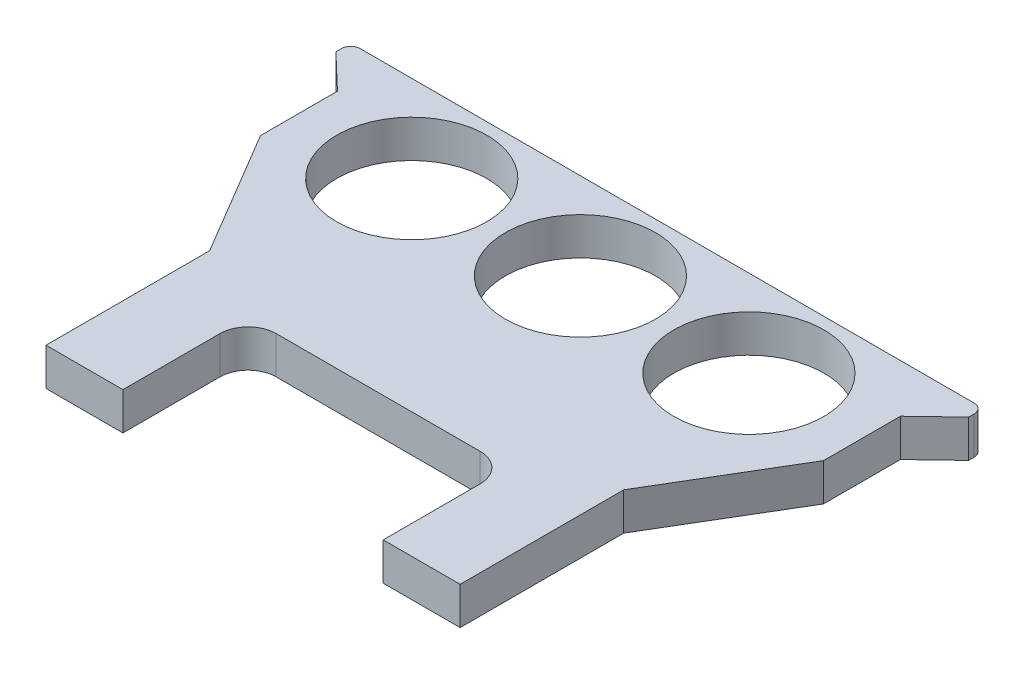
ISO-10303-21;
HEADER;
FILE_DESCRIPTION(('STEP AP214'),'2;1');
FILE_NAME('part.step','',(''),(''),'','','');
FILE_SCHEMA(('AUTOMOTIVE_DESIGN { 1 0 10303 214 1 1 1 1 }'));
ENDSEC;
DATA;
#1=APPLICATION_CONTEXT('core data for automotive mechanical design processes');
#2=APPLICATION_PROTOCOL_DEFINITION('international standard','automotive_design',2000,#1);
#3=PRODUCT_CONTEXT('',#1,'mechanical');
#4=PRODUCT('Part','Part','',(#3));
#5=PRODUCT_RELATED_PRODUCT_CATEGORY('part','',(#4));
#6=PRODUCT_DEFINITION_FORMATION('','',#4);
#7=PRODUCT_DEFINITION_CONTEXT('part definition',#1,'design');
#8=PRODUCT_DEFINITION('design','',#6,#7);
#9=PRODUCT_DEFINITION_SHAPE('','',#8);
#10=(LENGTH_UNIT() NAMED_UNIT(*) SI_UNIT(.MILLI.,.METRE.));
#11=(NAMED_UNIT(*) PLANE_ANGLE_UNIT() SI_UNIT($,.RADIAN.));
#12=(NAMED_UNIT(*) SI_UNIT($,.STERADIAN.) SOLID_ANGLE_UNIT());
#13=UNCERTAINTY_MEASURE_WITH_UNIT(LENGTH_MEASURE(1.E-05),#10,'distance_accuracy_value','');
#14=(GEOMETRIC_REPRESENTATION_CONTEXT(3) GLOBAL_UNCERTAINTY_ASSIGNED_CONTEXT((#13)) GLOBAL_UNIT_ASSIGNED_CONTEXT((#10,
#11,#12)) REPRESENTATION_CONTEXT('',''));
#15=CARTESIAN_POINT('',(0.,0.,0.));
#16=DIRECTION('',(0.,0.,1.));
#17=DIRECTION('',(1.,0.,0.));
#18=AXIS2_PLACEMENT_3D('',#15,#16,#17);
#19=CARTESIAN_POINT('',(-16.3510386858923,2.,-17.200505886366));
#20=DIRECTION('',(0.,-1.,0.));
#21=DIRECTION('',(0.,0.,-1.));
#22=AXIS2_PLACEMENT_3D('',#19,#20,#21);
#23=CYLINDRICAL_SURFACE('',#22,0.5);
#24=CARTESIAN_POINT('',(-16.3510386858923,0.,-17.200505886366));
#25=DIRECTION('',(0.,-1.,0.));
#26=DIRECTION('',(0.,0.,-1.));
#27=AXIS2_PLACEMENT_3D('',#24,#25,#26);
#28=CIRCLE('',#27,0.5);
#29=CARTESIAN_POINT('',(-16.8510386858923,0.,-17.200505886366));
#30=VERTEX_POINT('',#29);
#31=CARTESIAN_POINT('',(-16.3510386858923,0.,-17.700505886366));
#32=VERTEX_POINT('',#31);
#33=EDGE_CURVE('E213',#30,#32,#28,.T.);
#34=ORIENTED_EDGE('',*,*,#33,.F.);
#35=DIRECTION('',(0.,-1.,0.));
#36=VECTOR('',#35,1.);
#37=CARTESIAN_POINT('',(-16.8510386858923,2.,-17.200505886366));
#38=LINE('',#37,#36);
#39=CARTESIAN_POINT('',(-16.8510386858923,2.,-17.200505886366));
#40=VERTEX_POINT('',#39);
#41=EDGE_CURVE('E48',#40,#30,#38,.T.);
#42=ORIENTED_EDGE('',*,*,#41,.F.);
#43=CARTESIAN_POINT('',(-16.3510386858923,2.,-17.200505886366));
#44=DIRECTION('',(0.,-1.,0.));
#45=DIRECTION('',(0.,0.,-1.));
#46=AXIS2_PLACEMENT_3D('',#43,#44,#45);
#47=CIRCLE('',#46,0.5);
#48=CARTESIAN_POINT('',(-16.3510386858923,2.,-17.700505886366));
#49=VERTEX_POINT('',#48);
#50=EDGE_CURVE('E361',#40,#49,#47,.T.);
#51=ORIENTED_EDGE('',*,*,#50,.T.);
#52=DIRECTION('',(0.,-1.,0.));
#53=VECTOR('',#52,1.);
#54=CARTESIAN_POINT('',(-16.3510386858923,2.,-17.700505886366));
#55=LINE('',#54,#53);
#56=EDGE_CURVE('E11',#49,#32,#55,.T.);
#57=ORIENTED_EDGE('',*,*,#56,.T.);
#58=EDGE_LOOP('',(#34,#42,#51,#57));
#59=FACE_BOUND('',#58,.T.);
#60=ADVANCED_FACE('F39',(#59),#23,.T.);
#61=CARTESIAN_POINT('',(-16.8510386858923,2.,-16.9056671422906));
#62=DIRECTION('',(-1.,0.,0.));
#63=DIRECTION('',(0.,0.,1.));
#64=AXIS2_PLACEMENT_3D('',#61,#62,#63);
#65=PLANE('',#64);
#66=DIRECTION('',(0.,0.,-1.));
#67=VECTOR('',#66,1.);
#68=CARTESIAN_POINT('',(-16.8510386858923,0.,-16.9056671422906));
#69=LINE('',#68,#67);
#70=CARTESIAN_POINT('',(-16.8510386858923,0.,-16.9056671422906));
#71=VERTEX_POINT('',#70);
#72=EDGE_CURVE('E217',#71,#30,#69,.T.);
#73=ORIENTED_EDGE('',*,*,#72,.F.);
#74=DIRECTION('',(0.,-1.,0.));
#75=VECTOR('',#74,1.);
#76=CARTESIAN_POINT('',(-16.8510386858923,2.,-16.9056671422906));
#77=LINE('',#76,#75);
#78=CARTESIAN_POINT('',(-16.8510386858923,2.,-16.9056671422906));
#79=VERTEX_POINT('',#78);
#80=EDGE_CURVE('E334',#79,#71,#77,.T.);
#81=ORIENTED_EDGE('',*,*,#80,.F.);
#82=DIRECTION('',(0.,0.,-1.));
#83=VECTOR('',#82,1.);
#84=CARTESIAN_POINT('',(-16.8510386858923,2.,-16.9056671422906));
#85=LINE('',#84,#83);
#86=EDGE_CURVE('E343',#79,#40,#85,.T.);
#87=ORIENTED_EDGE('',*,*,#86,.T.);
#88=ORIENTED_EDGE('',*,*,#41,.T.);
#89=EDGE_LOOP('',(#73,#81,#87,#88));
#90=FACE_BOUND('',#89,.T.);
#91=ADVANCED_FACE('F341',(#90),#65,.T.);
#92=CARTESIAN_POINT('',(-16.8510386858923,2.,-16.9056671422906));
#93=DIRECTION('',(0.690724224095173,0.,-0.723118279569893));
#94=DIRECTION('',(-0.723118279569893,0.,-0.690724224095173));
#95=AXIS2_PLACEMENT_3D('',#92,#93,#94);
#96=PLANE('',#95);
#97=DIRECTION('',(0.723118279569893,0.,0.690724224095173));
#98=VECTOR('',#97,1.);
#99=CARTESIAN_POINT('',(-16.8510386858923,0.,-16.9056671422906));
#100=LINE('',#99,#98);
#101=CARTESIAN_POINT('',(-14.9926247073977,0.,-15.130505886366));
#102=VERTEX_POINT('',#101);
#103=EDGE_CURVE('E222',#71,#102,#100,.T.);
#104=ORIENTED_EDGE('',*,*,#103,.T.);
#105=DIRECTION('',(0.,-1.,0.));
#106=VECTOR('',#105,1.);
#107=CARTESIAN_POINT('',(-14.9926247073977,2.,-15.130505886366));
#108=LINE('',#107,#106);
#109=CARTESIAN_POINT('',(-14.9926247073977,2.,-15.130505886366));
#110=VERTEX_POINT('',#109);
#111=EDGE_CURVE('E331',#110,#102,#108,.T.);
#112=ORIENTED_EDGE('',*,*,#111,.F.);
#113=DIRECTION('',(0.723118279569893,0.,0.690724224095173));
#114=VECTOR('',#113,1.);
#115=CARTESIAN_POINT('',(-16.8510386858923,2.,-16.9056671422906));
#116=LINE('',#115,#114);
#117=EDGE_CURVE('E356',#79,#110,#116,.T.);
#118=ORIENTED_EDGE('',*,*,#117,.F.);
#119=ORIENTED_EDGE('',*,*,#80,.T.);
#120=EDGE_LOOP('',(#104,#112,#118,#119));
#121=FACE_BOUND('',#120,.T.);
#122=ADVANCED_FACE('F353',(#121),#96,.F.);
#123=CARTESIAN_POINT('',(-14.9926247073977,2.,-11.030505886366));
#124=DIRECTION('',(-1.,0.,0.));
#125=DIRECTION('',(0.,0.,1.));
#126=AXIS2_PLACEMENT_3D('',#123,#124,#125);
#127=PLANE('',#126);
#128=DIRECTION('',(0.,0.,-1.));
#129=VECTOR('',#128,1.);
#130=CARTESIAN_POINT('',(-14.9926247073977,0.,-11.030505886366));
#131=LINE('',#130,#129);
#132=CARTESIAN_POINT('',(-14.9926247073977,0.,-11.030505886366));
#133=VERTEX_POINT('',#132);
#134=EDGE_CURVE('E226',#133,#102,#131,.T.);
#135=ORIENTED_EDGE('',*,*,#134,.F.);
#136=DIRECTION('',(0.,-1.,0.));
#137=VECTOR('',#136,1.);
#138=CARTESIAN_POINT('',(-14.9926247073977,2.,-11.030505886366));
#139=LINE('',#138,#137);
#140=CARTESIAN_POINT('',(-14.9926247073977,2.,-11.030505886366));
#141=VERTEX_POINT('',#140);
#142=EDGE_CURVE('E328',#141,#133,#139,.T.);
#143=ORIENTED_EDGE('',*,*,#142,.F.);
#144=DIRECTION('',(0.,0.,-1.));
#145=VECTOR('',#144,1.);
#146=CARTESIAN_POINT('',(-14.9926247073977,2.,-11.030505886366));
#147=LINE('',#146,#145);
#148=EDGE_CURVE('E359',#141,#110,#147,.T.);
#149=ORIENTED_EDGE('',*,*,#148,.T.);
#150=ORIENTED_EDGE('',*,*,#111,.T.);
#151=EDGE_LOOP('',(#135,#143,#149,#150));
#152=FACE_BOUND('',#151,.T.);
#153=ADVANCED_FACE('F434',(#152),#127,.T.);
#154=CARTESIAN_POINT('',(-14.9926247073977,2.,-11.030505886366));
#155=DIRECTION('',(0.860023822414832,0.,-0.51025388276718));
#156=DIRECTION('',(-0.51025388276718,0.,-0.860023822414832));
#157=AXIS2_PLACEMENT_3D('',#154,#155,#156);
#158=PLANE('',#157);
#159=DIRECTION('',(0.51025388276718,0.,0.860023822414832));
#160=VECTOR('',#159,1.);
#161=CARTESIAN_POINT('',(-14.9926247073977,0.,-11.030505886366));
#162=LINE('',#161,#160);
#163=CARTESIAN_POINT('',(-11.035,0.,-4.36));
#164=VERTEX_POINT('',#163);
#165=EDGE_CURVE('E230',#133,#164,#162,.T.);
#166=ORIENTED_EDGE('',*,*,#165,.T.);
#167=DIRECTION('',(0.,-1.,0.));
#168=VECTOR('',#167,1.);
#169=CARTESIAN_POINT('',(-11.035,2.,-4.36));
#170=LINE('',#169,#168);
#171=CARTESIAN_POINT('',(-11.035,2.,-4.36));
#172=VERTEX_POINT('',#171);
#173=EDGE_CURVE('E325',#172,#164,#170,.T.);
#174=ORIENTED_EDGE('',*,*,#173,.F.);
#175=DIRECTION('',(0.51025388276718,0.,0.860023822414832));
#176=VECTOR('',#175,1.);
#177=CARTESIAN_POINT('',(-14.9926247073977,2.,-11.030505886366));
#178=LINE('',#177,#176);
#179=EDGE_CURVE('E370',#141,#172,#178,.T.);
#180=ORIENTED_EDGE('',*,*,#179,.F.);
#181=ORIENTED_EDGE('',*,*,#142,.T.);
#182=EDGE_LOOP('',(#166,#174,#180,#181));
#183=FACE_BOUND('',#182,.T.);
#184=ADVANCED_FACE('F439',(#183),#158,.F.);
#185=CARTESIAN_POINT('',(-11.035,2.,4.36));
#186=DIRECTION('',(-1.,0.,0.));
#187=DIRECTION('',(0.,0.,1.));
#188=AXIS2_PLACEMENT_3D('',#185,#186,#187);
#189=PLANE('',#188);
#190=DIRECTION('',(0.,0.,-1.));
#191=VECTOR('',#190,1.);
#192=CARTESIAN_POINT('',(-11.035,0.,4.36));
#193=LINE('',#192,#191);
#194=CARTESIAN_POINT('',(-11.035,0.,4.36));
#195=VERTEX_POINT('',#194);
#196=EDGE_CURVE('E234',#195,#164,#193,.T.);
#197=ORIENTED_EDGE('',*,*,#196,.F.);
#198=DIRECTION('',(0.,-1.,0.));
#199=VECTOR('',#198,1.);
#200=CARTESIAN_POINT('',(-11.035,2.,4.36));
#201=LINE('',#200,#199);
#202=CARTESIAN_POINT('',(-11.035,2.,4.36));
#203=VERTEX_POINT('',#202);
#204=EDGE_CURVE('E322',#203,#195,#201,.T.);
#205=ORIENTED_EDGE('',*,*,#204,.F.);
#206=DIRECTION('',(0.,0.,-1.));
#207=VECTOR('',#206,1.);
#208=CARTESIAN_POINT('',(-11.035,2.,4.36));
#209=LINE('',#208,#207);
#210=EDGE_CURVE('E373',#203,#172,#209,.T.);
#211=ORIENTED_EDGE('',*,*,#210,.T.);
#212=ORIENTED_EDGE('',*,*,#173,.T.);
#213=EDGE_LOOP('',(#197,#205,#211,#212));
#214=FACE_BOUND('',#213,.T.);
#215=ADVANCED_FACE('F443',(#214),#189,.T.);
#216=CARTESIAN_POINT('',(-11.035,2.,4.36));
#217=DIRECTION('',(0.,0.,-1.));
#218=DIRECTION('',(-1.,0.,0.));
#219=AXIS2_PLACEMENT_3D('',#216,#217,#218);
#220=PLANE('',#219);
#221=DIRECTION('',(1.,0.,0.));
#222=VECTOR('',#221,1.);
#223=CARTESIAN_POINT('',(-11.035,0.,4.36));
#224=LINE('',#223,#222);
#225=CARTESIAN_POINT('',(-6.935,0.,4.36));
#226=VERTEX_POINT('',#225);
#227=EDGE_CURVE('E238',#195,#226,#224,.T.);
#228=ORIENTED_EDGE('',*,*,#227,.T.);
#229=DIRECTION('',(0.,-1.,0.));
#230=VECTOR('',#229,1.);
#231=CARTESIAN_POINT('',(-6.935,2.,4.36));
#232=LINE('',#231,#230);
#233=CARTESIAN_POINT('',(-6.935,2.,4.36));
#234=VERTEX_POINT('',#233);
#235=EDGE_CURVE('E318',#234,#226,#232,.T.);
#236=ORIENTED_EDGE('',*,*,#235,.F.);
#237=DIRECTION('',(1.,0.,0.));
#238=VECTOR('',#237,1.);
#239=CARTESIAN_POINT('',(-11.035,2.,4.36));
#240=LINE('',#239,#238);
#241=EDGE_CURVE('E377',#203,#234,#240,.T.);
#242=ORIENTED_EDGE('',*,*,#241,.F.);
#243=ORIENTED_EDGE('',*,*,#204,.T.);
#244=EDGE_LOOP('',(#228,#236,#242,#243));
#245=FACE_BOUND('',#244,.T.);
#246=ADVANCED_FACE('F447',(#245),#220,.F.);
#247=CARTESIAN_POINT('',(-6.935,2.,4.36));
#248=DIRECTION('',(-1.,0.,0.));
#249=DIRECTION('',(0.,0.,1.));
#250=AXIS2_PLACEMENT_3D('',#247,#248,#249);
#251=PLANE('',#250);
#252=DIRECTION('',(0.,0.,-1.));
#253=VECTOR('',#252,1.);
#254=CARTESIAN_POINT('',(-6.935,0.,4.36));
#255=LINE('',#254,#253);
#256=CARTESIAN_POINT('',(-6.935,0.,-0.80999999999999));
#257=VERTEX_POINT('',#256);
#258=EDGE_CURVE('E241',#226,#257,#255,.T.);
#259=ORIENTED_EDGE('',*,*,#258,.T.);
#260=DIRECTION('',(0.,-1.,0.));
#261=VECTOR('',#260,1.);
#262=CARTESIAN_POINT('',(-6.935,2.,-0.80999999999999));
#263=LINE('',#262,#261);
#264=CARTESIAN_POINT('',(-6.935,2.,-0.80999999999999));
#265=VERTEX_POINT('',#264);
#266=EDGE_CURVE('E315',#265,#257,#263,.T.);
#267=ORIENTED_EDGE('',*,*,#266,.F.);
#268=DIRECTION('',(0.,0.,-1.));
#269=VECTOR('',#268,1.);
#270=CARTESIAN_POINT('',(-6.935,2.,4.36));
#271=LINE('',#270,#269);
#272=EDGE_CURVE('E380',#234,#265,#271,.T.);
#273=ORIENTED_EDGE('',*,*,#272,.F.);
#274=ORIENTED_EDGE('',*,*,#235,.T.);
#275=EDGE_LOOP('',(#259,#267,#273,#274));
#276=FACE_BOUND('',#275,.T.);
#277=ADVANCED_FACE('F451',(#276),#251,.F.);
#278=CARTESIAN_POINT('',(-5.435,2.,-0.810000000000001));
#279=DIRECTION('',(0.,-1.,0.));
#280=DIRECTION('',(0.,0.,-1.));
#281=AXIS2_PLACEMENT_3D('',#278,#279,#280);
#282=CYLINDRICAL_SURFACE('',#281,1.5);
#283=CARTESIAN_POINT('',(-5.435,0.,-0.810000000000001));
#284=DIRECTION('',(0.,1.,0.));
#285=DIRECTION('',(0.,0.,1.));
#286=AXIS2_PLACEMENT_3D('',#283,#284,#285);
#287=CIRCLE('',#286,1.5);
#288=CARTESIAN_POINT('',(-5.43499999999999,0.,-2.31));
#289=VERTEX_POINT('',#288);
#290=EDGE_CURVE('E245',#289,#257,#287,.T.);
#291=ORIENTED_EDGE('',*,*,#290,.F.);
#292=DIRECTION('',(0.,-1.,0.));
#293=VECTOR('',#292,1.);
#294=CARTESIAN_POINT('',(-5.43499999999999,2.,-2.31));
#295=LINE('',#294,#293);
#296=CARTESIAN_POINT('',(-5.43499999999999,2.,-2.31));
#297=VERTEX_POINT('',#296);
#298=EDGE_CURVE('E312',#297,#289,#295,.T.);
#299=ORIENTED_EDGE('',*,*,#298,.F.);
#300=CARTESIAN_POINT('',(-5.435,2.,-0.810000000000001));
#301=DIRECTION('',(0.,1.,0.));
#302=DIRECTION('',(0.,0.,1.));
#303=AXIS2_PLACEMENT_3D('',#300,#301,#302);
#304=CIRCLE('',#303,1.5);
#305=EDGE_CURVE('E383',#297,#265,#304,.T.);
#306=ORIENTED_EDGE('',*,*,#305,.T.);
#307=ORIENTED_EDGE('',*,*,#266,.T.);
#308=EDGE_LOOP('',(#291,#299,#306,#307));
#309=FACE_BOUND('',#308,.T.);
#310=ADVANCED_FACE('F455',(#309),#282,.F.);
#311=CARTESIAN_POINT('',(-5.43499999999999,2.,-2.31));
#312=DIRECTION('',(0.,0.,-1.));
#313=DIRECTION('',(-1.,0.,0.));
#314=AXIS2_PLACEMENT_3D('',#311,#312,#313);
#315=PLANE('',#314);
#316=DIRECTION('',(1.,0.,0.));
#317=VECTOR('',#316,1.);
#318=CARTESIAN_POINT('',(-5.43499999999999,0.,-2.31));
#319=LINE('',#318,#317);
#320=CARTESIAN_POINT('',(5.43499999999999,0.,-2.31));
#321=VERTEX_POINT('',#320);
#322=EDGE_CURVE('E249',#289,#321,#319,.T.);
#323=ORIENTED_EDGE('',*,*,#322,.T.);
#324=DIRECTION('',(0.,-1.,0.));
#325=VECTOR('',#324,1.);
#326=CARTESIAN_POINT('',(5.43499999999999,2.,-2.31));
#327=LINE('',#326,#325);
#328=CARTESIAN_POINT('',(5.43499999999999,2.,-2.31));
#329=VERTEX_POINT('',#328);
#330=EDGE_CURVE('E308',#329,#321,#327,.T.);
#331=ORIENTED_EDGE('',*,*,#330,.F.);
#332=DIRECTION('',(1.,0.,0.));
#333=VECTOR('',#332,1.);
#334=CARTESIAN_POINT('',(-5.43499999999999,2.,-2.31));
#335=LINE('',#334,#333);
#336=EDGE_CURVE('E387',#297,#329,#335,.T.);
#337=ORIENTED_EDGE('',*,*,#336,.F.);
#338=ORIENTED_EDGE('',*,*,#298,.T.);
#339=EDGE_LOOP('',(#323,#331,#337,#338));
#340=FACE_BOUND('',#339,.T.);
#341=ADVANCED_FACE('F459',(#340),#315,.F.);
#342=CARTESIAN_POINT('',(5.435,2.,-0.810000000000001));
#343=DIRECTION('',(0.,-1.,0.));
#344=DIRECTION('',(0.,0.,-1.));
#345=AXIS2_PLACEMENT_3D('',#342,#343,#344);
#346=CYLINDRICAL_SURFACE('',#345,1.5);
#347=CARTESIAN_POINT('',(5.435,0.,-0.810000000000001));
#348=DIRECTION('',(0.,-1.,0.));
#349=DIRECTION('',(0.,0.,-1.));
#350=AXIS2_PLACEMENT_3D('',#347,#348,#349);
#351=CIRCLE('',#350,1.5);
#352=CARTESIAN_POINT('',(6.935,0.,-0.80999999999999));
#353=VERTEX_POINT('',#352);
#354=EDGE_CURVE('E252',#321,#353,#351,.T.);
#355=ORIENTED_EDGE('',*,*,#354,.T.);
#356=DIRECTION('',(0.,-1.,0.));
#357=VECTOR('',#356,1.);
#358=CARTESIAN_POINT('',(6.935,2.,-0.80999999999999));
#359=LINE('',#358,#357);
#360=CARTESIAN_POINT('',(6.935,2.,-0.80999999999999));
#361=VERTEX_POINT('',#360);
#362=EDGE_CURVE('E305',#361,#353,#359,.T.);
#363=ORIENTED_EDGE('',*,*,#362,.F.);
#364=CARTESIAN_POINT('',(5.435,2.,-0.810000000000001));
#365=DIRECTION('',(0.,-1.,0.));
#366=DIRECTION('',(0.,0.,-1.));
#367=AXIS2_PLACEMENT_3D('',#364,#365,#366);
#368=CIRCLE('',#367,1.5);
#369=EDGE_CURVE('E390',#329,#361,#368,.T.);
#370=ORIENTED_EDGE('',*,*,#369,.F.);
#371=ORIENTED_EDGE('',*,*,#330,.T.);
#372=EDGE_LOOP('',(#355,#363,#370,#371));
#373=FACE_BOUND('',#372,.T.);
#374=ADVANCED_FACE('F463',(#373),#346,.F.);
#375=CARTESIAN_POINT('',(6.935,2.,4.36));
#376=DIRECTION('',(-1.,0.,0.));
#377=DIRECTION('',(0.,0.,1.));
#378=AXIS2_PLACEMENT_3D('',#375,#376,#377);
#379=PLANE('',#378);
#380=DIRECTION('',(0.,0.,-1.));
#381=VECTOR('',#380,1.);
#382=CARTESIAN_POINT('',(6.935,0.,4.36));
#383=LINE('',#382,#381);
#384=CARTESIAN_POINT('',(6.935,0.,4.36));
#385=VERTEX_POINT('',#384);
#386=EDGE_CURVE('E256',#385,#353,#383,.T.);
#387=ORIENTED_EDGE('',*,*,#386,.F.);
#388=DIRECTION('',(0.,-1.,0.));
#389=VECTOR('',#388,1.);
#390=CARTESIAN_POINT('',(6.935,2.,4.36));
#391=LINE('',#390,#389);
#392=CARTESIAN_POINT('',(6.935,2.,4.36));
#393=VERTEX_POINT('',#392);
#394=EDGE_CURVE('E302',#393,#385,#391,.T.);
#395=ORIENTED_EDGE('',*,*,#394,.F.);
#396=DIRECTION('',(0.,0.,-1.));
#397=VECTOR('',#396,1.);
#398=CARTESIAN_POINT('',(6.935,2.,4.36));
#399=LINE('',#398,#397);
#400=EDGE_CURVE('E393',#393,#361,#399,.T.);
#401=ORIENTED_EDGE('',*,*,#400,.T.);
#402=ORIENTED_EDGE('',*,*,#362,.T.);
#403=EDGE_LOOP('',(#387,#395,#401,#402));
#404=FACE_BOUND('',#403,.T.);
#405=ADVANCED_FACE('F467',(#404),#379,.T.);
#406=CARTESIAN_POINT('',(6.935,2.,4.36));
#407=DIRECTION('',(0.,0.,-1.));
#408=DIRECTION('',(-1.,0.,0.));
#409=AXIS2_PLACEMENT_3D('',#406,#407,#408);
#410=PLANE('',#409);
#411=DIRECTION('',(1.,0.,0.));
#412=VECTOR('',#411,1.);
#413=CARTESIAN_POINT('',(6.935,0.,4.36));
#414=LINE('',#413,#412);
#415=CARTESIAN_POINT('',(11.035,0.,4.36));
#416=VERTEX_POINT('',#415);
#417=EDGE_CURVE('E260',#385,#416,#414,.T.);
#418=ORIENTED_EDGE('',*,*,#417,.T.);
#419=DIRECTION('',(0.,-1.,0.));
#420=VECTOR('',#419,1.);
#421=CARTESIAN_POINT('',(11.035,2.,4.36));
#422=LINE('',#421,#420);
#423=CARTESIAN_POINT('',(11.035,2.,4.36));
#424=VERTEX_POINT('',#423);
#425=EDGE_CURVE('E298',#424,#416,#422,.T.);
#426=ORIENTED_EDGE('',*,*,#425,.F.);
#427=DIRECTION('',(1.,0.,0.));
#428=VECTOR('',#427,1.);
#429=CARTESIAN_POINT('',(6.935,2.,4.36));
#430=LINE('',#429,#428);
#431=EDGE_CURVE('E397',#393,#424,#430,.T.);
#432=ORIENTED_EDGE('',*,*,#431,.F.);
#433=ORIENTED_EDGE('',*,*,#394,.T.);
#434=EDGE_LOOP('',(#418,#426,#432,#433));
#435=FACE_BOUND('',#434,.T.);
#436=ADVANCED_FACE('F471',(#435),#410,.F.);
#437=CARTESIAN_POINT('',(11.035,2.,4.36));
#438=DIRECTION('',(-1.,0.,0.));
#439=DIRECTION('',(0.,0.,1.));
#440=AXIS2_PLACEMENT_3D('',#437,#438,#439);
#441=PLANE('',#440);
#442=DIRECTION('',(0.,0.,-1.));
#443=VECTOR('',#442,1.);
#444=CARTESIAN_POINT('',(11.035,0.,4.36));
#445=LINE('',#444,#443);
#446=CARTESIAN_POINT('',(11.035,0.,-4.36));
#447=VERTEX_POINT('',#446);
#448=EDGE_CURVE('E263',#416,#447,#445,.T.);
#449=ORIENTED_EDGE('',*,*,#448,.T.);
#450=DIRECTION('',(0.,-1.,0.));
#451=VECTOR('',#450,1.);
#452=CARTESIAN_POINT('',(11.035,2.,-4.36));
#453=LINE('',#452,#451);
#454=CARTESIAN_POINT('',(11.035,2.,-4.36));
#455=VERTEX_POINT('',#454);
#456=EDGE_CURVE('E295',#455,#447,#453,.T.);
#457=ORIENTED_EDGE('',*,*,#456,.F.);
#458=DIRECTION('',(0.,0.,-1.));
#459=VECTOR('',#458,1.);
#460=CARTESIAN_POINT('',(11.035,2.,4.36));
#461=LINE('',#460,#459);
#462=EDGE_CURVE('E400',#424,#455,#461,.T.);
#463=ORIENTED_EDGE('',*,*,#462,.F.);
#464=ORIENTED_EDGE('',*,*,#425,.T.);
#465=EDGE_LOOP('',(#449,#457,#463,#464));
#466=FACE_BOUND('',#465,.T.);
#467=ADVANCED_FACE('F413',(#466),#441,.F.);
#468=CARTESIAN_POINT('',(15.01,2.,-11.03));
#469=DIRECTION('',(0.859023219069794,0.,0.511936626057336));
#470=DIRECTION('',(0.511936626057336,0.,-0.859023219069794));
#471=AXIS2_PLACEMENT_3D('',#468,#469,#470);
#472=PLANE('',#471);
#473=DIRECTION('',(-0.511936626057336,0.,0.859023219069794));
#474=VECTOR('',#473,1.);
#475=CARTESIAN_POINT('',(15.01,0.,-11.03));
#476=LINE('',#475,#474);
#477=CARTESIAN_POINT('',(15.01,0.,-11.03));
#478=VERTEX_POINT('',#477);
#479=EDGE_CURVE('E267',#478,#447,#476,.T.);
#480=ORIENTED_EDGE('',*,*,#479,.F.);
#481=DIRECTION('',(0.,-1.,0.));
#482=VECTOR('',#481,1.);
#483=CARTESIAN_POINT('',(15.01,2.,-11.03));
#484=LINE('',#483,#482);
#485=CARTESIAN_POINT('',(15.01,2.,-11.03));
#486=VERTEX_POINT('',#485);
#487=EDGE_CURVE('E292',#486,#478,#484,.T.);
#488=ORIENTED_EDGE('',*,*,#487,.F.);
#489=DIRECTION('',(-0.511936626057336,0.,0.859023219069794));
#490=VECTOR('',#489,1.);
#491=CARTESIAN_POINT('',(15.01,2.,-11.03));
#492=LINE('',#491,#490);
#493=EDGE_CURVE('E207',#486,#455,#492,.T.);
#494=ORIENTED_EDGE('',*,*,#493,.T.);
#495=ORIENTED_EDGE('',*,*,#456,.T.);
#496=EDGE_LOOP('',(#480,#488,#494,#495));
#497=FACE_BOUND('',#496,.T.);
#498=ADVANCED_FACE('F406',(#497),#472,.T.);
#499=CARTESIAN_POINT('',(15.01,2.,-11.03));
#500=DIRECTION('',(-1.,0.,0.));
#501=DIRECTION('',(0.,0.,1.));
#502=AXIS2_PLACEMENT_3D('',#499,#500,#501);
#503=PLANE('',#502);
#504=DIRECTION('',(0.,0.,-1.));
#505=VECTOR('',#504,1.);
#506=CARTESIAN_POINT('',(15.01,0.,-11.03));
#507=LINE('',#506,#505);
#508=CARTESIAN_POINT('',(15.01,0.,-15.13));
#509=VERTEX_POINT('',#508);
#510=EDGE_CURVE('E271',#478,#509,#507,.T.);
#511=ORIENTED_EDGE('',*,*,#510,.T.);
#512=DIRECTION('',(0.,-1.,0.));
#513=VECTOR('',#512,1.);
#514=CARTESIAN_POINT('',(15.01,2.,-15.13));
#515=LINE('',#514,#513);
#516=CARTESIAN_POINT('',(15.01,2.,-15.13));
#517=VERTEX_POINT('',#516);
#518=EDGE_CURVE('E190',#517,#509,#515,.T.);
#519=ORIENTED_EDGE('',*,*,#518,.F.);
#520=DIRECTION('',(0.,0.,-1.));
#521=VECTOR('',#520,1.);
#522=CARTESIAN_POINT('',(15.01,2.,-11.03));
#523=LINE('',#522,#521);
#524=EDGE_CURVE('E202',#486,#517,#523,.T.);
#525=ORIENTED_EDGE('',*,*,#524,.F.);
#526=ORIENTED_EDGE('',*,*,#487,.T.);
#527=EDGE_LOOP('',(#511,#519,#525,#526));
#528=FACE_BOUND('',#527,.T.);
#529=ADVANCED_FACE('F418',(#528),#503,.F.);
#530=CARTESIAN_POINT('',(16.868239420902,2.,-16.9053439820513));
#531=DIRECTION('',(0.690795323755383,0.,0.723050358327618));
#532=DIRECTION('',(0.723050358327618,0.,-0.690795323755383));
#533=AXIS2_PLACEMENT_3D('',#530,#531,#532);
#534=PLANE('',#533);
#535=DIRECTION('',(-0.723050358327618,0.,0.690795323755382));
#536=VECTOR('',#535,1.);
#537=CARTESIAN_POINT('',(16.868239420902,0.,-16.9053439820513));
#538=LINE('',#537,#536);
#539=CARTESIAN_POINT('',(16.868239420902,0.,-16.9053439820513));
#540=VERTEX_POINT('',#539);
#541=EDGE_CURVE('E188',#540,#509,#538,.T.);
#542=ORIENTED_EDGE('',*,*,#541,.F.);
#543=DIRECTION('',(0.,-1.,0.));
#544=VECTOR('',#543,1.);
#545=CARTESIAN_POINT('',(16.868239420902,2.,-16.9053439820513));
#546=LINE('',#545,#544);
#547=CARTESIAN_POINT('',(16.868239420902,2.,-16.9053439820513));
#548=VERTEX_POINT('',#547);
#549=EDGE_CURVE('E182',#548,#540,#546,.T.);
#550=ORIENTED_EDGE('',*,*,#549,.F.);
#551=DIRECTION('',(-0.723050358327618,0.,0.690795323755382));
#552=VECTOR('',#551,1.);
#553=CARTESIAN_POINT('',(16.868239420902,2.,-16.9053439820513));
#554=LINE('',#553,#552);
#555=EDGE_CURVE('E186',#548,#517,#554,.T.);
#556=ORIENTED_EDGE('',*,*,#555,.T.);
#557=ORIENTED_EDGE('',*,*,#518,.T.);
#558=EDGE_LOOP('',(#542,#550,#556,#557));
#559=FACE_BOUND('',#558,.T.);
#560=ADVANCED_FACE('F184',(#559),#534,.T.);
#561=CARTESIAN_POINT('',(16.868239420902,2.,-16.9053439820513));
#562=DIRECTION('',(-1.,0.,0.));
#563=DIRECTION('',(0.,0.,1.));
#564=AXIS2_PLACEMENT_3D('',#561,#562,#563);
#565=PLANE('',#564);
#566=DIRECTION('',(0.,0.,-1.));
#567=VECTOR('',#566,1.);
#568=CARTESIAN_POINT('',(16.868239420902,0.,-16.9053439820513));
#569=LINE('',#568,#567);
#570=CARTESIAN_POINT('',(16.868239420902,0.,-17.200505886366));
#571=VERTEX_POINT('',#570);
#572=EDGE_CURVE('E121',#540,#571,#569,.T.);
#573=ORIENTED_EDGE('',*,*,#572,.T.);
#574=DIRECTION('',(0.,-1.,0.));
#575=VECTOR('',#574,1.);
#576=CARTESIAN_POINT('',(16.868239420902,2.,-17.200505886366));
#577=LINE('',#576,#575);
#578=CARTESIAN_POINT('',(16.868239420902,2.,-17.200505886366));
#579=VERTEX_POINT('',#578);
#580=EDGE_CURVE('E191',#579,#571,#577,.T.);
#581=ORIENTED_EDGE('',*,*,#580,.F.);
#582=DIRECTION('',(0.,0.,-1.));
#583=VECTOR('',#582,1.);
#584=CARTESIAN_POINT('',(16.868239420902,2.,-16.9053439820513));
#585=LINE('',#584,#583);
#586=EDGE_CURVE('E193',#548,#579,#585,.T.);
#587=ORIENTED_EDGE('',*,*,#586,.F.);
#588=ORIENTED_EDGE('',*,*,#549,.T.);
#589=EDGE_LOOP('',(#573,#581,#587,#588));
#590=FACE_BOUND('',#589,.T.);
#591=ADVANCED_FACE('F194',(#590),#565,.F.);
#592=CARTESIAN_POINT('',(16.368239420902,2.,-17.200505886366));
#593=DIRECTION('',(0.,-1.,0.));
#594=DIRECTION('',(0.,0.,-1.));
#595=AXIS2_PLACEMENT_3D('',#592,#593,#594);
#596=CYLINDRICAL_SURFACE('',#595,0.5);
#597=CARTESIAN_POINT('',(16.368239420902,0.,-17.200505886366));
#598=DIRECTION('',(0.,1.,0.));
#599=DIRECTION('',(0.,0.,1.));
#600=AXIS2_PLACEMENT_3D('',#597,#598,#599);
#601=CIRCLE('',#600,0.5);
#602=CARTESIAN_POINT('',(16.368239420902,0.,-17.700505886366));
#603=VERTEX_POINT('',#602);
#604=EDGE_CURVE('E279',#571,#603,#601,.T.);
#605=ORIENTED_EDGE('',*,*,#604,.T.);
#606=DIRECTION('',(0.,-1.,0.));
#607=VECTOR('',#606,1.);
#608=CARTESIAN_POINT('',(16.368239420902,2.,-17.700505886366));
#609=LINE('',#608,#607);
#610=CARTESIAN_POINT('',(16.368239420902,2.,-17.700505886366));
#611=VERTEX_POINT('',#610);
#612=EDGE_CURVE('E125',#611,#603,#609,.T.);
#613=ORIENTED_EDGE('',*,*,#612,.F.);
#614=CARTESIAN_POINT('',(16.368239420902,2.,-17.200505886366));
#615=DIRECTION('',(0.,1.,0.));
#616=DIRECTION('',(0.,0.,1.));
#617=AXIS2_PLACEMENT_3D('',#614,#615,#616);
#618=CIRCLE('',#617,0.5);
#619=EDGE_CURVE('E197',#579,#611,#618,.T.);
#620=ORIENTED_EDGE('',*,*,#619,.F.);
#621=ORIENTED_EDGE('',*,*,#580,.T.);
#622=EDGE_LOOP('',(#605,#613,#620,#621));
#623=FACE_BOUND('',#622,.T.);
#624=ADVANCED_FACE('F504',(#623),#596,.T.);
#625=CARTESIAN_POINT('',(-14.9926247073977,2.,-17.700505886366));
#626=DIRECTION('',(0.,0.,-1.));
#627=DIRECTION('',(-1.,0.,0.));
#628=AXIS2_PLACEMENT_3D('',#625,#626,#627);
#629=PLANE('',#628);
#630=DIRECTION('',(1.,0.,0.));
#631=VECTOR('',#630,1.);
#632=CARTESIAN_POINT('',(-14.9926247073977,0.,-17.700505886366));
#633=LINE('',#632,#631);
#634=EDGE_CURVE('E282',#32,#603,#633,.T.);
#635=ORIENTED_EDGE('',*,*,#634,.F.);
#636=ORIENTED_EDGE('',*,*,#56,.F.);
#637=DIRECTION('',(-1.,0.,0.));
#638=VECTOR('',#637,1.);
#639=CARTESIAN_POINT('',(-14.9926247073977,2.,-17.700505886366));
#640=LINE('',#639,#638);
#641=EDGE_CURVE('E56',#611,#49,#640,.T.);
#642=ORIENTED_EDGE('',*,*,#641,.F.);
#643=ORIENTED_EDGE('',*,*,#612,.T.);
#644=EDGE_LOOP('',(#635,#636,#642,#643));
#645=FACE_BOUND('',#644,.T.);
#646=ADVANCED_FACE('F513',(#645),#629,.T.);
#647=CARTESIAN_POINT('',(-16.3510386858923,2.,-17.200505886366));
#648=DIRECTION('',(0.,-1.,0.));
#649=DIRECTION('',(0.,0.,-1.));
#650=AXIS2_PLACEMENT_3D('',#647,#648,#649);
#651=PLANE('',#650);
#652=CARTESIAN_POINT('',(-8.985,2.,-13.080505886366));
#653=DIRECTION('',(0.,1.,0.));
#654=DIRECTION('',(0.,0.,1.));
#655=AXIS2_PLACEMENT_3D('',#652,#653,#654);
#656=CIRCLE('',#655,4.);
#657=CARTESIAN_POINT('',(-8.985,2.,-9.08050588636596));
#658=VERTEX_POINT('',#657);
#659=EDGE_CURVE('E578',#658,#658,#656,.T.);
#660=ORIENTED_EDGE('',*,*,#659,.F.);
#661=EDGE_LOOP('',(#660));
#662=FACE_BOUND('',#661,.T.);
#663=CARTESIAN_POINT('',(0.00688301015201589,2.,-13.08));
#664=DIRECTION('',(0.,1.,0.));
#665=DIRECTION('',(0.,0.,1.));
#666=AXIS2_PLACEMENT_3D('',#663,#664,#665);
#667=CIRCLE('',#666,4.);
#668=CARTESIAN_POINT('',(0.00688301015201589,2.,-9.08));
#669=VERTEX_POINT('',#668);
#670=EDGE_CURVE('E588',#669,#669,#667,.T.);
#671=ORIENTED_EDGE('',*,*,#670,.F.);
#672=EDGE_LOOP('',(#671));
#673=FACE_BOUND('',#672,.T.);
#674=CARTESIAN_POINT('',(8.98500000000001,2.,-13.080101589957));
#675=DIRECTION('',(0.,1.,0.));
#676=DIRECTION('',(0.,0.,1.));
#677=AXIS2_PLACEMENT_3D('',#674,#675,#676);
#678=CIRCLE('',#677,4.);
#679=CARTESIAN_POINT('',(8.98500000000001,2.,-9.08010158995703));
#680=VERTEX_POINT('',#679);
#681=EDGE_CURVE('E218',#680,#680,#678,.T.);
#682=ORIENTED_EDGE('',*,*,#681,.F.);
#683=EDGE_LOOP('',(#682));
#684=FACE_BOUND('',#683,.T.);
#685=ORIENTED_EDGE('',*,*,#641,.T.);
#686=ORIENTED_EDGE('',*,*,#50,.F.);
#687=ORIENTED_EDGE('',*,*,#86,.F.);
#688=ORIENTED_EDGE('',*,*,#117,.T.);
#689=ORIENTED_EDGE('',*,*,#148,.F.);
#690=ORIENTED_EDGE('',*,*,#179,.T.);
#691=ORIENTED_EDGE('',*,*,#210,.F.);
#692=ORIENTED_EDGE('',*,*,#241,.T.);
#693=ORIENTED_EDGE('',*,*,#272,.T.);
#694=ORIENTED_EDGE('',*,*,#305,.F.);
#695=ORIENTED_EDGE('',*,*,#336,.T.);
#696=ORIENTED_EDGE('',*,*,#369,.T.);
#697=ORIENTED_EDGE('',*,*,#400,.F.);
#698=ORIENTED_EDGE('',*,*,#431,.T.);
#699=ORIENTED_EDGE('',*,*,#462,.T.);
#700=ORIENTED_EDGE('',*,*,#493,.F.);
#701=ORIENTED_EDGE('',*,*,#524,.T.);
#702=ORIENTED_EDGE('',*,*,#555,.F.);
#703=ORIENTED_EDGE('',*,*,#586,.T.);
#704=ORIENTED_EDGE('',*,*,#619,.T.);
#705=EDGE_LOOP('',(#685,#686,#687,#688,#689,#690,#691,#692,#693,#694,#695,#696,#697,#698,#699,
#700,#701,#702,#703,#704));
#706=FACE_BOUND('',#705,.T.);
#707=ADVANCED_FACE('F199',(#662,#673,#684,#706),#651,.F.);
#708=CARTESIAN_POINT('',(-16.3510386858923,0.,-17.200505886366));
#709=DIRECTION('',(0.,-1.,0.));
#710=DIRECTION('',(0.,0.,-1.));
#711=AXIS2_PLACEMENT_3D('',#708,#709,#710);
#712=PLANE('',#711);
#713=CARTESIAN_POINT('',(-8.985,0.,-13.080505886366));
#714=DIRECTION('',(0.,1.,0.));
#715=DIRECTION('',(0.,0.,1.));
#716=AXIS2_PLACEMENT_3D('',#713,#714,#715);
#717=CIRCLE('',#716,4.);
#718=CARTESIAN_POINT('',(-8.985,0.,-9.08050588636596));
#719=VERTEX_POINT('',#718);
#720=EDGE_CURVE('E581',#719,#719,#717,.T.);
#721=ORIENTED_EDGE('',*,*,#720,.T.);
#722=EDGE_LOOP('',(#721));
#723=FACE_BOUND('',#722,.T.);
#724=CARTESIAN_POINT('',(0.00688301015201589,0.,-13.08));
#725=DIRECTION('',(0.,1.,0.));
#726=DIRECTION('',(0.,0.,1.));
#727=AXIS2_PLACEMENT_3D('',#724,#725,#726);
#728=CIRCLE('',#727,4.);
#729=CARTESIAN_POINT('',(0.00688301015201589,0.,-9.08));
#730=VERTEX_POINT('',#729);
#731=EDGE_CURVE('E585',#730,#730,#728,.T.);
#732=ORIENTED_EDGE('',*,*,#731,.T.);
#733=EDGE_LOOP('',(#732));
#734=FACE_BOUND('',#733,.T.);
#735=CARTESIAN_POINT('',(8.98500000000001,0.,-13.080101589957));
#736=DIRECTION('',(0.,1.,0.));
#737=DIRECTION('',(0.,0.,1.));
#738=AXIS2_PLACEMENT_3D('',#735,#736,#737);
#739=CIRCLE('',#738,4.);
#740=CARTESIAN_POINT('',(8.98500000000001,0.,-9.08010158995703));
#741=VERTEX_POINT('',#740);
#742=EDGE_CURVE('E592',#741,#741,#739,.T.);
#743=ORIENTED_EDGE('',*,*,#742,.T.);
#744=EDGE_LOOP('',(#743));
#745=FACE_BOUND('',#744,.T.);
#746=ORIENTED_EDGE('',*,*,#33,.T.);
#747=ORIENTED_EDGE('',*,*,#634,.T.);
#748=ORIENTED_EDGE('',*,*,#604,.F.);
#749=ORIENTED_EDGE('',*,*,#572,.F.);
#750=ORIENTED_EDGE('',*,*,#541,.T.);
#751=ORIENTED_EDGE('',*,*,#510,.F.);
#752=ORIENTED_EDGE('',*,*,#479,.T.);
#753=ORIENTED_EDGE('',*,*,#448,.F.);
#754=ORIENTED_EDGE('',*,*,#417,.F.);
#755=ORIENTED_EDGE('',*,*,#386,.T.);
#756=ORIENTED_EDGE('',*,*,#354,.F.);
#757=ORIENTED_EDGE('',*,*,#322,.F.);
#758=ORIENTED_EDGE('',*,*,#290,.T.);
#759=ORIENTED_EDGE('',*,*,#258,.F.);
#760=ORIENTED_EDGE('',*,*,#227,.F.);
#761=ORIENTED_EDGE('',*,*,#196,.T.);
#762=ORIENTED_EDGE('',*,*,#165,.F.);
#763=ORIENTED_EDGE('',*,*,#134,.T.);
#764=ORIENTED_EDGE('',*,*,#103,.F.);
#765=ORIENTED_EDGE('',*,*,#72,.T.);
#766=EDGE_LOOP('',(#746,#747,#748,#749,#750,#751,#752,#753,#754,#755,#756,#757,#758,#759,#760,
#761,#762,#763,#764,#765));
#767=FACE_BOUND('',#766,.T.);
#768=ADVANCED_FACE('F348',(#723,#734,#745,#767),#712,.T.);
#769=CARTESIAN_POINT('',(8.98500000000001,2.,-13.080101589957));
#770=DIRECTION('',(0.,-1.,0.));
#771=DIRECTION('',(0.,0.,-1.));
#772=AXIS2_PLACEMENT_3D('',#769,#770,#771);
#773=CYLINDRICAL_SURFACE('',#772,4.);
#774=ORIENTED_EDGE('',*,*,#681,.T.);
#775=EDGE_LOOP('',(#774));
#776=FACE_BOUND('',#775,.T.);
#777=ORIENTED_EDGE('',*,*,#742,.F.);
#778=EDGE_LOOP('',(#777));
#779=FACE_BOUND('',#778,.T.);
#780=ADVANCED_FACE('F530',(#776,#779),#773,.F.);
#781=CARTESIAN_POINT('',(0.00688301015201589,2.,-13.08));
#782=DIRECTION('',(0.,-1.,0.));
#783=DIRECTION('',(0.,0.,-1.));
#784=AXIS2_PLACEMENT_3D('',#781,#782,#783);
#785=CYLINDRICAL_SURFACE('',#784,4.);
#786=ORIENTED_EDGE('',*,*,#670,.T.);
#787=EDGE_LOOP('',(#786));
#788=FACE_BOUND('',#787,.T.);
#789=ORIENTED_EDGE('',*,*,#731,.F.);
#790=EDGE_LOOP('',(#789));
#791=FACE_BOUND('',#790,.T.);
#792=ADVANCED_FACE('F535',(#788,#791),#785,.F.);
#793=CARTESIAN_POINT('',(-8.985,2.,-13.080505886366));
#794=DIRECTION('',(0.,-1.,0.));
#795=DIRECTION('',(0.,0.,-1.));
#796=AXIS2_PLACEMENT_3D('',#793,#794,#795);
#797=CYLINDRICAL_SURFACE('',#796,4.);
#798=ORIENTED_EDGE('',*,*,#659,.T.);
#799=EDGE_LOOP('',(#798));
#800=FACE_BOUND('',#799,.T.);
#801=ORIENTED_EDGE('',*,*,#720,.F.);
#802=EDGE_LOOP('',(#801));
#803=FACE_BOUND('',#802,.T.);
#804=ADVANCED_FACE('F547',(#800,#803),#797,.F.);
#805=CLOSED_SHELL('',(#60,#91,#122,#153,#184,#215,#246,#277,#310,#341,#374,#405,#436,#467,#498,
#529,#560,#591,#624,#646,#707,#768,#780,#792,#804));
#806=MANIFOLD_SOLID_BREP('B2',#805);
#807=ADVANCED_BREP_SHAPE_REPRESENTATION('',(#18,#806),#14);
#808=SHAPE_DEFINITION_REPRESENTATION(#9,#807);
ENDSEC;
END-ISO-10303-21;
